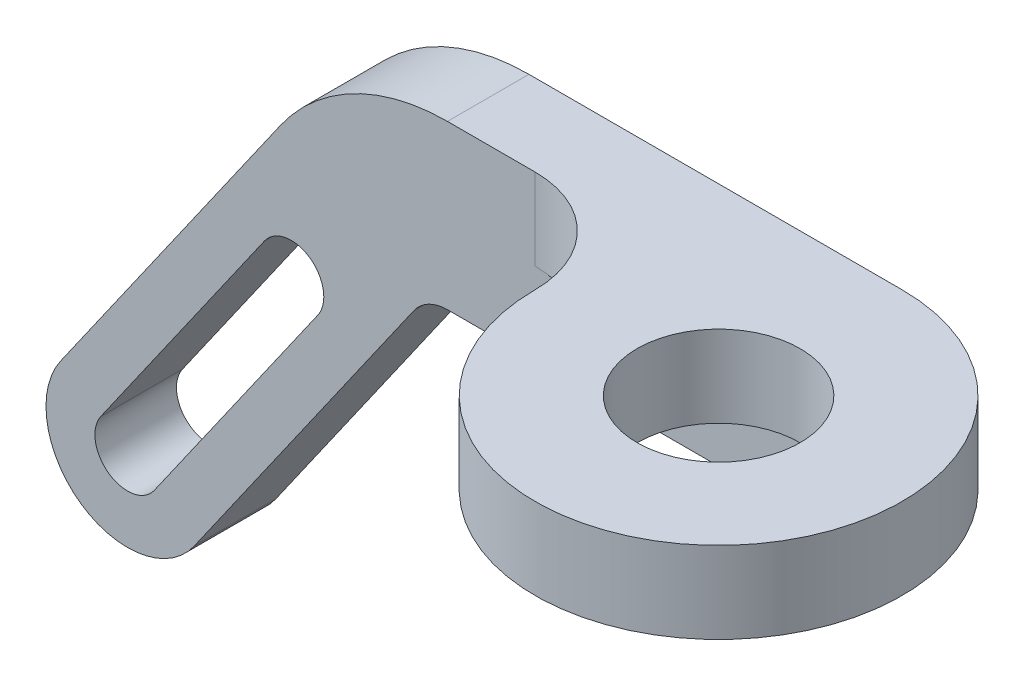
ISO-10303-21;
HEADER;
FILE_DESCRIPTION(('STEP AP214'),'2;1');
FILE_NAME('part.step','',(''),(''),'','','');
FILE_SCHEMA(('AUTOMOTIVE_DESIGN { 1 0 10303 214 1 1 1 1 }'));
ENDSEC;
DATA;
#1=APPLICATION_CONTEXT('core data for automotive mechanical design processes');
#2=APPLICATION_PROTOCOL_DEFINITION('international standard','automotive_design',2000,#1);
#3=PRODUCT_CONTEXT('',#1,'mechanical');
#4=PRODUCT('Part','Part','',(#3));
#5=PRODUCT_RELATED_PRODUCT_CATEGORY('part','',(#4));
#6=PRODUCT_DEFINITION_FORMATION('','',#4);
#7=PRODUCT_DEFINITION_CONTEXT('part definition',#1,'design');
#8=PRODUCT_DEFINITION('design','',#6,#7);
#9=PRODUCT_DEFINITION_SHAPE('','',#8);
#10=(LENGTH_UNIT() NAMED_UNIT(*) SI_UNIT(.MILLI.,.METRE.));
#11=(NAMED_UNIT(*) PLANE_ANGLE_UNIT() SI_UNIT($,.RADIAN.));
#12=(NAMED_UNIT(*) SI_UNIT($,.STERADIAN.) SOLID_ANGLE_UNIT());
#13=UNCERTAINTY_MEASURE_WITH_UNIT(LENGTH_MEASURE(1.E-05),#10,'distance_accuracy_value','');
#14=(GEOMETRIC_REPRESENTATION_CONTEXT(3) GLOBAL_UNCERTAINTY_ASSIGNED_CONTEXT((#13)) GLOBAL_UNIT_ASSIGNED_CONTEXT((#10,
#11,#12)) REPRESENTATION_CONTEXT('',''));
#15=CARTESIAN_POINT('',(0.,0.,0.));
#16=DIRECTION('',(0.,0.,1.));
#17=DIRECTION('',(1.,0.,0.));
#18=AXIS2_PLACEMENT_3D('',#15,#16,#17);
#19=CARTESIAN_POINT('',(61.3570505088352,33.1382695259347,5.));
#20=DIRECTION('',(-1.,0.,0.));
#21=DIRECTION('',(0.,-1.,0.));
#22=AXIS2_PLACEMENT_3D('',#19,#20,#21);
#23=PLANE('',#22);
#24=CARTESIAN_POINT('',(61.3570505088353,18.1382695259347,0.));
#25=DIRECTION('',(1.,0.,0.));
#26=DIRECTION('',(0.,0.,-1.));
#27=AXIS2_PLACEMENT_3D('',#24,#25,#26);
#28=CIRCLE('',#27,0.875000000000001);
#29=CARTESIAN_POINT('',(61.3570505088353,18.1382695259347,-0.875000000000002));
#30=VERTEX_POINT('',#29);
#31=EDGE_CURVE('E149',#30,#30,#28,.T.);
#32=ORIENTED_EDGE('',*,*,#31,.F.);
#33=EDGE_LOOP('',(#32));
#34=FACE_BOUND('',#33,.T.);
#35=DIRECTION('',(0.,0.,-1.));
#36=VECTOR('',#35,1.);
#37=CARTESIAN_POINT('',(61.3570505088353,23.1382695259347,11.3010627053414));
#38=LINE('',#37,#36);
#39=CARTESIAN_POINT('',(61.3570505088353,23.1382695259347,5.));
#40=VERTEX_POINT('',#39);
#41=CARTESIAN_POINT('',(61.3570505088353,23.1382695259347,-5.));
#42=VERTEX_POINT('',#41);
#43=EDGE_CURVE('E168',#40,#42,#38,.T.);
#44=ORIENTED_EDGE('',*,*,#43,.F.);
#45=DIRECTION('',(0.,1.,0.));
#46=VECTOR('',#45,1.);
#47=CARTESIAN_POINT('',(61.3570505088352,33.1382695259347,5.));
#48=LINE('',#47,#46);
#49=CARTESIAN_POINT('',(61.3570505088353,13.1382695259347,5.));
#50=VERTEX_POINT('',#49);
#51=EDGE_CURVE('E210',#50,#40,#48,.T.);
#52=ORIENTED_EDGE('',*,*,#51,.F.);
#53=DIRECTION('',(0.,0.,-1.));
#54=VECTOR('',#53,1.);
#55=CARTESIAN_POINT('',(61.3570505088353,13.1382695259347,5.));
#56=LINE('',#55,#54);
#57=CARTESIAN_POINT('',(61.3570505088353,13.1382695259347,-5.));
#58=VERTEX_POINT('',#57);
#59=EDGE_CURVE('E228',#50,#58,#56,.T.);
#60=ORIENTED_EDGE('',*,*,#59,.T.);
#61=DIRECTION('',(0.,1.,0.));
#62=VECTOR('',#61,1.);
#63=CARTESIAN_POINT('',(61.3570505088352,33.1382695259347,-5.));
#64=LINE('',#63,#62);
#65=EDGE_CURVE('E209',#58,#42,#64,.T.);
#66=ORIENTED_EDGE('',*,*,#65,.T.);
#67=EDGE_LOOP('',(#44,#52,#60,#66));
#68=FACE_BOUND('',#67,.T.);
#69=ADVANCED_FACE('F34',(#34,#68),#23,.F.);
#70=CARTESIAN_POINT('',(15.5942925108019,8.13826952593468,5.));
#71=DIRECTION('',(0.,0.,1.));
#72=DIRECTION('',(1.,0.,0.));
#73=AXIS2_PLACEMENT_3D('',#70,#71,#72);
#74=PLANE('',#73);
#75=DIRECTION('',(0.,1.,0.));
#76=VECTOR('',#75,1.);
#77=CARTESIAN_POINT('',(26.3570505088352,23.1382695259347,5.));
#78=LINE('',#77,#76);
#79=CARTESIAN_POINT('',(26.3570505088352,23.1382695259347,5.));
#80=VERTEX_POINT('',#79);
#81=CARTESIAN_POINT('',(26.3570505088352,33.1382695259347,5.));
#82=VERTEX_POINT('',#81);
#83=EDGE_CURVE('E170',#80,#82,#78,.T.);
#84=ORIENTED_EDGE('',*,*,#83,.T.);
#85=DIRECTION('',(-1.,0.,0.));
#86=VECTOR('',#85,1.);
#87=CARTESIAN_POINT('',(15.5942925108019,33.1382695259347,5.));
#88=LINE('',#87,#86);
#89=CARTESIAN_POINT('',(15.5942925108019,33.1382695259347,5.));
#90=VERTEX_POINT('',#89);
#91=EDGE_CURVE('E213',#82,#90,#88,.T.);
#92=ORIENTED_EDGE('',*,*,#91,.T.);
#93=CARTESIAN_POINT('',(15.5942925108019,8.13826952593466,5.));
#94=DIRECTION('',(0.,0.,1.));
#95=DIRECTION('',(1.,0.,0.));
#96=AXIS2_PLACEMENT_3D('',#93,#94,#95);
#97=CIRCLE('',#96,25.);
#98=CARTESIAN_POINT('',(-4.88450859642281,22.4776804347109,5.));
#99=VERTEX_POINT('',#98);
#100=EDGE_CURVE('E216',#90,#99,#97,.T.);
#101=ORIENTED_EDGE('',*,*,#100,.T.);
#102=DIRECTION('',(-0.57357643635105,-0.819152044288989,0.));
#103=VECTOR('',#102,1.);
#104=CARTESIAN_POINT('',(-4.88450859642281,22.4776804347109,5.));
#105=LINE('',#104,#103);
#106=CARTESIAN_POINT('',(-31.8344699340547,-16.0108531314047,5.));
#107=VERTEX_POINT('',#106);
#108=EDGE_CURVE('E218',#99,#107,#105,.T.);
#109=ORIENTED_EDGE('',*,*,#108,.T.);
#110=CARTESIAN_POINT('',(-23.6429494911648,-21.7466174949152,5.));
#111=DIRECTION('',(0.,0.,1.));
#112=DIRECTION('',(1.,0.,0.));
#113=AXIS2_PLACEMENT_3D('',#110,#111,#112);
#114=CIRCLE('',#113,10.);
#115=CARTESIAN_POINT('',(-15.4514290482749,-27.4823818584257,5.));
#116=VERTEX_POINT('',#115);
#117=EDGE_CURVE('E220',#107,#116,#114,.T.);
#118=ORIENTED_EDGE('',*,*,#117,.T.);
#119=DIRECTION('',(0.573576436351049,0.819152044288989,0.));
#120=VECTOR('',#119,1.);
#121=CARTESIAN_POINT('',(11.498532289357,11.0061517076899,5.));
#122=LINE('',#121,#120);
#123=CARTESIAN_POINT('',(11.498532289357,11.0061517076899,5.));
#124=VERTEX_POINT('',#123);
#125=EDGE_CURVE('E222',#116,#124,#122,.T.);
#126=ORIENTED_EDGE('',*,*,#125,.T.);
#127=CARTESIAN_POINT('',(15.5942925108019,8.13826952593468,5.));
#128=DIRECTION('',(0.,0.,-1.));
#129=DIRECTION('',(1.,0.,0.));
#130=AXIS2_PLACEMENT_3D('',#127,#128,#129);
#131=CIRCLE('',#130,5.);
#132=CARTESIAN_POINT('',(15.5942925108019,13.1382695259347,5.));
#133=VERTEX_POINT('',#132);
#134=EDGE_CURVE('E224',#124,#133,#131,.T.);
#135=ORIENTED_EDGE('',*,*,#134,.T.);
#136=DIRECTION('',(1.,0.,0.));
#137=VECTOR('',#136,1.);
#138=CARTESIAN_POINT('',(15.5942925108019,13.1382695259347,5.));
#139=LINE('',#138,#137);
#140=EDGE_CURVE('E226',#133,#50,#139,.T.);
#141=ORIENTED_EDGE('',*,*,#140,.T.);
#142=ORIENTED_EDGE('',*,*,#51,.T.);
#143=DIRECTION('',(-1.,0.,0.));
#144=VECTOR('',#143,1.);
#145=CARTESIAN_POINT('',(-12.2631316034933,23.1382695259347,5.));
#146=LINE('',#145,#144);
#147=EDGE_CURVE('E158',#40,#80,#146,.T.);
#148=ORIENTED_EDGE('',*,*,#147,.T.);
#149=EDGE_LOOP('',(#84,#92,#101,#109,#118,#126,#135,#141,#142,#148));
#150=FACE_BOUND('',#149,.T.);
#151=DIRECTION('',(0.573576436351049,0.81915204428899,0.));
#152=VECTOR('',#151,1.);
#153=CARTESIAN_POINT('',(-20.3663413140088,-24.0409232403194,5.));
#154=LINE('',#153,#152);
#155=CARTESIAN_POINT('',(-20.3663413140088,-24.0409232403194,5.));
#156=VERTEX_POINT('',#155);
#157=CARTESIAN_POINT('',(-0.291166041722065,4.62939830979524,5.));
#158=VERTEX_POINT('',#157);
#159=EDGE_CURVE('E186',#156,#158,#154,.T.);
#160=ORIENTED_EDGE('',*,*,#159,.F.);
#161=CARTESIAN_POINT('',(-23.6429494911648,-21.7466174949152,5.));
#162=DIRECTION('',(0.,0.,1.));
#163=DIRECTION('',(1.,0.,0.));
#164=AXIS2_PLACEMENT_3D('',#161,#162,#163);
#165=CIRCLE('',#164,3.99999999999999);
#166=CARTESIAN_POINT('',(-26.9195576683207,-19.452311749511,5.));
#167=VERTEX_POINT('',#166);
#168=EDGE_CURVE('E184',#167,#156,#165,.T.);
#169=ORIENTED_EDGE('',*,*,#168,.F.);
#170=DIRECTION('',(-0.573576436351049,-0.81915204428899,0.));
#171=VECTOR('',#170,1.);
#172=CARTESIAN_POINT('',(-26.9195576683207,-19.452311749511,5.));
#173=LINE('',#172,#171);
#174=CARTESIAN_POINT('',(-6.84438239603398,9.21800980060363,5.));
#175=VERTEX_POINT('',#174);
#176=EDGE_CURVE('E191',#175,#167,#173,.T.);
#177=ORIENTED_EDGE('',*,*,#176,.F.);
#178=CARTESIAN_POINT('',(-3.56777421887801,6.92370405519944,5.));
#179=DIRECTION('',(0.,0.,1.));
#180=DIRECTION('',(1.,0.,0.));
#181=AXIS2_PLACEMENT_3D('',#178,#179,#180);
#182=CIRCLE('',#181,3.99999999999999);
#183=EDGE_CURVE('E189',#158,#175,#182,.T.);
#184=ORIENTED_EDGE('',*,*,#183,.F.);
#185=EDGE_LOOP('',(#160,#169,#177,#184));
#186=FACE_BOUND('',#185,.T.);
#187=ADVANCED_FACE('F285',(#150,#186),#74,.T.);
#188=CARTESIAN_POINT('',(15.5942925108019,8.13826952593468,-5.));
#189=DIRECTION('',(0.,0.,1.));
#190=DIRECTION('',(1.,0.,0.));
#191=AXIS2_PLACEMENT_3D('',#188,#189,#190);
#192=PLANE('',#191);
#193=ORIENTED_EDGE('',*,*,#65,.F.);
#194=DIRECTION('',(1.,0.,0.));
#195=VECTOR('',#194,1.);
#196=CARTESIAN_POINT('',(15.5942925108019,13.1382695259347,-5.));
#197=LINE('',#196,#195);
#198=CARTESIAN_POINT('',(15.5942925108019,13.1382695259347,-5.));
#199=VERTEX_POINT('',#198);
#200=EDGE_CURVE('E214',#199,#58,#197,.T.);
#201=ORIENTED_EDGE('',*,*,#200,.F.);
#202=CARTESIAN_POINT('',(15.5942925108019,8.13826952593468,-5.));
#203=DIRECTION('',(0.,0.,-1.));
#204=DIRECTION('',(1.,0.,0.));
#205=AXIS2_PLACEMENT_3D('',#202,#203,#204);
#206=CIRCLE('',#205,5.);
#207=CARTESIAN_POINT('',(11.498532289357,11.0061517076899,-5.));
#208=VERTEX_POINT('',#207);
#209=EDGE_CURVE('E241',#208,#199,#206,.T.);
#210=ORIENTED_EDGE('',*,*,#209,.F.);
#211=DIRECTION('',(0.573576436351049,0.819152044288989,0.));
#212=VECTOR('',#211,1.);
#213=CARTESIAN_POINT('',(11.498532289357,11.0061517076899,-5.));
#214=LINE('',#213,#212);
#215=CARTESIAN_POINT('',(-15.4514290482749,-27.4823818584257,-5.));
#216=VERTEX_POINT('',#215);
#217=EDGE_CURVE('E239',#216,#208,#214,.T.);
#218=ORIENTED_EDGE('',*,*,#217,.F.);
#219=CARTESIAN_POINT('',(-23.6429494911648,-21.7466174949152,-5.));
#220=DIRECTION('',(0.,0.,1.));
#221=DIRECTION('',(1.,0.,0.));
#222=AXIS2_PLACEMENT_3D('',#219,#220,#221);
#223=CIRCLE('',#222,10.);
#224=CARTESIAN_POINT('',(-31.8344699340547,-16.0108531314047,-5.));
#225=VERTEX_POINT('',#224);
#226=EDGE_CURVE('E237',#225,#216,#223,.T.);
#227=ORIENTED_EDGE('',*,*,#226,.F.);
#228=DIRECTION('',(-0.57357643635105,-0.819152044288989,0.));
#229=VECTOR('',#228,1.);
#230=CARTESIAN_POINT('',(-4.88450859642281,22.4776804347109,-5.));
#231=LINE('',#230,#229);
#232=CARTESIAN_POINT('',(-4.88450859642281,22.4776804347109,-5.));
#233=VERTEX_POINT('',#232);
#234=EDGE_CURVE('E235',#233,#225,#231,.T.);
#235=ORIENTED_EDGE('',*,*,#234,.F.);
#236=CARTESIAN_POINT('',(15.5942925108019,8.13826952593466,-5.));
#237=DIRECTION('',(0.,0.,1.));
#238=DIRECTION('',(1.,0.,0.));
#239=AXIS2_PLACEMENT_3D('',#236,#237,#238);
#240=CIRCLE('',#239,25.);
#241=CARTESIAN_POINT('',(15.5942925108019,33.1382695259347,-5.));
#242=VERTEX_POINT('',#241);
#243=EDGE_CURVE('E233',#242,#233,#240,.T.);
#244=ORIENTED_EDGE('',*,*,#243,.F.);
#245=DIRECTION('',(-1.,0.,0.));
#246=VECTOR('',#245,1.);
#247=CARTESIAN_POINT('',(15.5942925108019,33.1382695259347,-5.));
#248=LINE('',#247,#246);
#249=CARTESIAN_POINT('',(61.3570505088352,33.1382695259347,-5.));
#250=VERTEX_POINT('',#249);
#251=EDGE_CURVE('E231',#250,#242,#248,.T.);
#252=ORIENTED_EDGE('',*,*,#251,.F.);
#253=DIRECTION('',(0.,1.,0.));
#254=VECTOR('',#253,1.);
#255=CARTESIAN_POINT('',(61.3570505088353,23.1382695259347,-5.));
#256=LINE('',#255,#254);
#257=EDGE_CURVE('E177',#42,#250,#256,.T.);
#258=ORIENTED_EDGE('',*,*,#257,.F.);
#259=EDGE_LOOP('',(#193,#201,#210,#218,#227,#235,#244,#252,#258));
#260=FACE_BOUND('',#259,.T.);
#261=CARTESIAN_POINT('',(-23.6429494911648,-21.7466174949152,-5.));
#262=DIRECTION('',(0.,0.,1.));
#263=DIRECTION('',(1.,0.,0.));
#264=AXIS2_PLACEMENT_3D('',#261,#262,#263);
#265=CIRCLE('',#264,3.99999999999999);
#266=CARTESIAN_POINT('',(-26.9195576683207,-19.452311749511,-5.));
#267=VERTEX_POINT('',#266);
#268=CARTESIAN_POINT('',(-20.3663413140088,-24.0409232403194,-5.));
#269=VERTEX_POINT('',#268);
#270=EDGE_CURVE('E56',#267,#269,#265,.T.);
#271=ORIENTED_EDGE('',*,*,#270,.T.);
#272=DIRECTION('',(0.573576436351049,0.81915204428899,0.));
#273=VECTOR('',#272,1.);
#274=CARTESIAN_POINT('',(-20.3663413140088,-24.0409232403194,-5.));
#275=LINE('',#274,#273);
#276=CARTESIAN_POINT('',(-0.291166041722065,4.62939830979524,-5.));
#277=VERTEX_POINT('',#276);
#278=EDGE_CURVE('E195',#269,#277,#275,.T.);
#279=ORIENTED_EDGE('',*,*,#278,.T.);
#280=CARTESIAN_POINT('',(-3.56777421887801,6.92370405519944,-5.));
#281=DIRECTION('',(0.,0.,1.));
#282=DIRECTION('',(1.,0.,0.));
#283=AXIS2_PLACEMENT_3D('',#280,#281,#282);
#284=CIRCLE('',#283,3.99999999999999);
#285=CARTESIAN_POINT('',(-6.84438239603397,9.21800980060363,-5.));
#286=VERTEX_POINT('',#285);
#287=EDGE_CURVE('E198',#277,#286,#284,.T.);
#288=ORIENTED_EDGE('',*,*,#287,.T.);
#289=DIRECTION('',(-0.573576436351049,-0.81915204428899,0.));
#290=VECTOR('',#289,1.);
#291=CARTESIAN_POINT('',(-26.9195576683207,-19.452311749511,-5.));
#292=LINE('',#291,#290);
#293=EDGE_CURVE('E187',#286,#267,#292,.T.);
#294=ORIENTED_EDGE('',*,*,#293,.T.);
#295=EDGE_LOOP('',(#271,#279,#288,#294));
#296=FACE_BOUND('',#295,.T.);
#297=ADVANCED_FACE('F270',(#260,#296),#192,.F.);
#298=CARTESIAN_POINT('',(15.5942925108019,33.1382695259347,5.));
#299=DIRECTION('',(0.,-1.,0.));
#300=DIRECTION('',(1.,0.,0.));
#301=AXIS2_PLACEMENT_3D('',#298,#299,#300);
#302=PLANE('',#301);
#303=ORIENTED_EDGE('',*,*,#91,.F.);
#304=CARTESIAN_POINT('',(26.3570505088352,33.1382695259347,17.5));
#305=DIRECTION('',(0.,1.,0.));
#306=DIRECTION('',(-1.,0.,0.));
#307=AXIS2_PLACEMENT_3D('',#304,#305,#306);
#308=CIRCLE('',#307,12.5);
#309=CARTESIAN_POINT('',(38.8570505088352,33.1382695259347,17.5));
#310=VERTEX_POINT('',#309);
#311=EDGE_CURVE('E173',#82,#310,#308,.F.);
#312=ORIENTED_EDGE('',*,*,#311,.T.);
#313=CARTESIAN_POINT('',(61.3570505088352,33.1382695259347,17.5));
#314=DIRECTION('',(0.,1.,0.));
#315=DIRECTION('',(-1.,0.,0.));
#316=AXIS2_PLACEMENT_3D('',#313,#314,#315);
#317=CIRCLE('',#316,22.5);
#318=EDGE_CURVE('E159',#310,#250,#317,.T.);
#319=ORIENTED_EDGE('',*,*,#318,.T.);
#320=ORIENTED_EDGE('',*,*,#251,.T.);
#321=DIRECTION('',(0.,0.,-1.));
#322=VECTOR('',#321,1.);
#323=CARTESIAN_POINT('',(15.5942925108019,33.1382695259347,5.));
#324=LINE('',#323,#322);
#325=EDGE_CURVE('E11',#90,#242,#324,.T.);
#326=ORIENTED_EDGE('',*,*,#325,.F.);
#327=EDGE_LOOP('',(#303,#312,#319,#320,#326));
#328=FACE_BOUND('',#327,.T.);
#329=CARTESIAN_POINT('',(61.3570505088352,33.1382695259347,17.5));
#330=DIRECTION('',(0.,1.,0.));
#331=DIRECTION('',(-1.,0.,0.));
#332=AXIS2_PLACEMENT_3D('',#329,#330,#331);
#333=CIRCLE('',#332,9.99999999999999);
#334=CARTESIAN_POINT('',(51.3570505088353,33.1382695259347,17.5));
#335=VERTEX_POINT('',#334);
#336=EDGE_CURVE('E152',#335,#335,#333,.T.);
#337=ORIENTED_EDGE('',*,*,#336,.F.);
#338=EDGE_LOOP('',(#337));
#339=FACE_BOUND('',#338,.T.);
#340=ADVANCED_FACE('F292',(#328,#339),#302,.F.);
#341=CARTESIAN_POINT('',(15.5942925108019,8.13826952593466,5.));
#342=DIRECTION('',(0.,0.,-1.));
#343=DIRECTION('',(-1.,0.,0.));
#344=AXIS2_PLACEMENT_3D('',#341,#342,#343);
#345=CYLINDRICAL_SURFACE('',#344,25.);
#346=ORIENTED_EDGE('',*,*,#243,.T.);
#347=DIRECTION('',(0.,0.,-1.));
#348=VECTOR('',#347,1.);
#349=CARTESIAN_POINT('',(-4.88450859642281,22.4776804347109,5.));
#350=LINE('',#349,#348);
#351=EDGE_CURVE('E41',#99,#233,#350,.T.);
#352=ORIENTED_EDGE('',*,*,#351,.F.);
#353=ORIENTED_EDGE('',*,*,#100,.F.);
#354=ORIENTED_EDGE('',*,*,#325,.T.);
#355=EDGE_LOOP('',(#346,#352,#353,#354));
#356=FACE_BOUND('',#355,.T.);
#357=ADVANCED_FACE('F290',(#356),#345,.T.);
#358=CARTESIAN_POINT('',(-4.88450859642281,22.4776804347109,5.));
#359=DIRECTION('',(0.819152044288989,-0.573576436351051,0.));
#360=DIRECTION('',(0.573576436351051,0.819152044288989,0.));
#361=AXIS2_PLACEMENT_3D('',#358,#359,#360);
#362=PLANE('',#361);
#363=ORIENTED_EDGE('',*,*,#234,.T.);
#364=DIRECTION('',(0.,0.,-1.));
#365=VECTOR('',#364,1.);
#366=CARTESIAN_POINT('',(-31.8344699340547,-16.0108531314047,5.));
#367=LINE('',#366,#365);
#368=EDGE_CURVE('E255',#107,#225,#367,.T.);
#369=ORIENTED_EDGE('',*,*,#368,.F.);
#370=ORIENTED_EDGE('',*,*,#108,.F.);
#371=ORIENTED_EDGE('',*,*,#351,.T.);
#372=EDGE_LOOP('',(#363,#369,#370,#371));
#373=FACE_BOUND('',#372,.T.);
#374=ADVANCED_FACE('F262',(#373),#362,.F.);
#375=CARTESIAN_POINT('',(-23.6429494911648,-21.7466174949152,5.));
#376=DIRECTION('',(0.,0.,-1.));
#377=DIRECTION('',(-1.,0.,0.));
#378=AXIS2_PLACEMENT_3D('',#375,#376,#377);
#379=CYLINDRICAL_SURFACE('',#378,10.);
#380=ORIENTED_EDGE('',*,*,#226,.T.);
#381=DIRECTION('',(0.,0.,-1.));
#382=VECTOR('',#381,1.);
#383=CARTESIAN_POINT('',(-15.4514290482749,-27.4823818584257,5.));
#384=LINE('',#383,#382);
#385=EDGE_CURVE('E252',#116,#216,#384,.T.);
#386=ORIENTED_EDGE('',*,*,#385,.F.);
#387=ORIENTED_EDGE('',*,*,#117,.F.);
#388=ORIENTED_EDGE('',*,*,#368,.T.);
#389=EDGE_LOOP('',(#380,#386,#387,#388));
#390=FACE_BOUND('',#389,.T.);
#391=ADVANCED_FACE('F277',(#390),#379,.T.);
#392=CARTESIAN_POINT('',(11.498532289357,11.0061517076899,5.));
#393=DIRECTION('',(-0.819152044288989,0.573576436351049,0.));
#394=DIRECTION('',(-0.57357643635105,-0.81915204428899,0.));
#395=AXIS2_PLACEMENT_3D('',#392,#393,#394);
#396=PLANE('',#395);
#397=ORIENTED_EDGE('',*,*,#217,.T.);
#398=DIRECTION('',(0.,0.,-1.));
#399=VECTOR('',#398,1.);
#400=CARTESIAN_POINT('',(11.498532289357,11.0061517076899,5.));
#401=LINE('',#400,#399);
#402=EDGE_CURVE('E249',#124,#208,#401,.T.);
#403=ORIENTED_EDGE('',*,*,#402,.F.);
#404=ORIENTED_EDGE('',*,*,#125,.F.);
#405=ORIENTED_EDGE('',*,*,#385,.T.);
#406=EDGE_LOOP('',(#397,#403,#404,#405));
#407=FACE_BOUND('',#406,.T.);
#408=ADVANCED_FACE('F281',(#407),#396,.F.);
#409=CARTESIAN_POINT('',(15.5942925108019,8.13826952593468,5.));
#410=DIRECTION('',(0.,0.,-1.));
#411=DIRECTION('',(-1.,0.,0.));
#412=AXIS2_PLACEMENT_3D('',#409,#410,#411);
#413=CYLINDRICAL_SURFACE('',#412,5.);
#414=ORIENTED_EDGE('',*,*,#209,.T.);
#415=DIRECTION('',(0.,0.,-1.));
#416=VECTOR('',#415,1.);
#417=CARTESIAN_POINT('',(15.5942925108019,13.1382695259347,5.));
#418=LINE('',#417,#416);
#419=EDGE_CURVE('E246',#133,#199,#418,.T.);
#420=ORIENTED_EDGE('',*,*,#419,.F.);
#421=ORIENTED_EDGE('',*,*,#134,.F.);
#422=ORIENTED_EDGE('',*,*,#402,.T.);
#423=EDGE_LOOP('',(#414,#420,#421,#422));
#424=FACE_BOUND('',#423,.T.);
#425=ADVANCED_FACE('F306',(#424),#413,.F.);
#426=CARTESIAN_POINT('',(15.5942925108019,13.1382695259347,5.));
#427=DIRECTION('',(0.,1.,0.));
#428=DIRECTION('',(-1.,0.,0.));
#429=AXIS2_PLACEMENT_3D('',#426,#427,#428);
#430=PLANE('',#429);
#431=ORIENTED_EDGE('',*,*,#200,.T.);
#432=ORIENTED_EDGE('',*,*,#59,.F.);
#433=ORIENTED_EDGE('',*,*,#140,.F.);
#434=ORIENTED_EDGE('',*,*,#419,.T.);
#435=EDGE_LOOP('',(#431,#432,#433,#434));
#436=FACE_BOUND('',#435,.T.);
#437=ADVANCED_FACE('F304',(#436),#430,.F.);
#438=CARTESIAN_POINT('',(-23.6429494911648,-21.7466174949152,5.));
#439=DIRECTION('',(0.,0.,-1.));
#440=DIRECTION('',(-1.,0.,0.));
#441=AXIS2_PLACEMENT_3D('',#438,#439,#440);
#442=CYLINDRICAL_SURFACE('',#441,3.99999999999999);
#443=ORIENTED_EDGE('',*,*,#270,.F.);
#444=DIRECTION('',(0.,0.,-1.));
#445=VECTOR('',#444,1.);
#446=CARTESIAN_POINT('',(-26.9195576683207,-19.452311749511,5.));
#447=LINE('',#446,#445);
#448=EDGE_CURVE('E193',#167,#267,#447,.T.);
#449=ORIENTED_EDGE('',*,*,#448,.F.);
#450=ORIENTED_EDGE('',*,*,#168,.T.);
#451=DIRECTION('',(0.,0.,-1.));
#452=VECTOR('',#451,1.);
#453=CARTESIAN_POINT('',(-20.3663413140088,-24.0409232403194,5.));
#454=LINE('',#453,#452);
#455=EDGE_CURVE('E207',#156,#269,#454,.T.);
#456=ORIENTED_EDGE('',*,*,#455,.T.);
#457=EDGE_LOOP('',(#443,#449,#450,#456));
#458=FACE_BOUND('',#457,.T.);
#459=ADVANCED_FACE('F313',(#458),#442,.F.);
#460=CARTESIAN_POINT('',(-20.3663413140088,-24.0409232403194,5.));
#461=DIRECTION('',(-0.81915204428899,0.573576436351049,0.));
#462=DIRECTION('',(-0.573576436351049,-0.81915204428899,0.));
#463=AXIS2_PLACEMENT_3D('',#460,#461,#462);
#464=PLANE('',#463);
#465=ORIENTED_EDGE('',*,*,#278,.F.);
#466=ORIENTED_EDGE('',*,*,#455,.F.);
#467=ORIENTED_EDGE('',*,*,#159,.T.);
#468=DIRECTION('',(0.,0.,-1.));
#469=VECTOR('',#468,1.);
#470=CARTESIAN_POINT('',(-0.291166041722065,4.62939830979524,5.));
#471=LINE('',#470,#469);
#472=EDGE_CURVE('E205',#158,#277,#471,.T.);
#473=ORIENTED_EDGE('',*,*,#472,.T.);
#474=EDGE_LOOP('',(#465,#466,#467,#473));
#475=FACE_BOUND('',#474,.T.);
#476=ADVANCED_FACE('F350',(#475),#464,.T.);
#477=CARTESIAN_POINT('',(-3.56777421887801,6.92370405519944,5.));
#478=DIRECTION('',(0.,0.,-1.));
#479=DIRECTION('',(-1.,0.,0.));
#480=AXIS2_PLACEMENT_3D('',#477,#478,#479);
#481=CYLINDRICAL_SURFACE('',#480,3.99999999999999);
#482=ORIENTED_EDGE('',*,*,#287,.F.);
#483=ORIENTED_EDGE('',*,*,#472,.F.);
#484=ORIENTED_EDGE('',*,*,#183,.T.);
#485=DIRECTION('',(0.,0.,-1.));
#486=VECTOR('',#485,1.);
#487=CARTESIAN_POINT('',(-6.84438239603397,9.21800980060363,5.));
#488=LINE('',#487,#486);
#489=EDGE_CURVE('E48',#175,#286,#488,.T.);
#490=ORIENTED_EDGE('',*,*,#489,.T.);
#491=EDGE_LOOP('',(#482,#483,#484,#490));
#492=FACE_BOUND('',#491,.T.);
#493=ADVANCED_FACE('F347',(#492),#481,.F.);
#494=CARTESIAN_POINT('',(-26.9195576683207,-19.452311749511,5.));
#495=DIRECTION('',(0.81915204428899,-0.573576436351049,0.));
#496=DIRECTION('',(0.573576436351049,0.81915204428899,0.));
#497=AXIS2_PLACEMENT_3D('',#494,#495,#496);
#498=PLANE('',#497);
#499=ORIENTED_EDGE('',*,*,#293,.F.);
#500=ORIENTED_EDGE('',*,*,#489,.F.);
#501=ORIENTED_EDGE('',*,*,#176,.T.);
#502=ORIENTED_EDGE('',*,*,#448,.T.);
#503=EDGE_LOOP('',(#499,#500,#501,#502));
#504=FACE_BOUND('',#503,.T.);
#505=ADVANCED_FACE('F338',(#504),#498,.T.);
#506=CARTESIAN_POINT('',(61.3570505088352,23.1382695259347,17.5));
#507=DIRECTION('',(0.,1.,0.));
#508=DIRECTION('',(-1.,0.,0.));
#509=AXIS2_PLACEMENT_3D('',#506,#507,#508);
#510=CYLINDRICAL_SURFACE('',#509,22.5);
#511=ORIENTED_EDGE('',*,*,#318,.F.);
#512=DIRECTION('',(0.,1.,0.));
#513=VECTOR('',#512,1.);
#514=CARTESIAN_POINT('',(38.8570505088352,23.1382695259347,17.5));
#515=LINE('',#514,#513);
#516=CARTESIAN_POINT('',(38.8570505088352,23.1382695259347,17.5));
#517=VERTEX_POINT('',#516);
#518=EDGE_CURVE('E180',#517,#310,#515,.T.);
#519=ORIENTED_EDGE('',*,*,#518,.F.);
#520=CARTESIAN_POINT('',(61.3570505088352,23.1382695259347,17.5));
#521=DIRECTION('',(0.,1.,0.));
#522=DIRECTION('',(-1.,0.,0.));
#523=AXIS2_PLACEMENT_3D('',#520,#521,#522);
#524=CIRCLE('',#523,22.5);
#525=EDGE_CURVE('E165',#517,#42,#524,.T.);
#526=ORIENTED_EDGE('',*,*,#525,.T.);
#527=ORIENTED_EDGE('',*,*,#257,.T.);
#528=EDGE_LOOP('',(#511,#519,#526,#527));
#529=FACE_BOUND('',#528,.T.);
#530=ADVANCED_FACE('F334',(#529),#510,.T.);
#531=CARTESIAN_POINT('',(61.3570505088352,23.1382695259347,17.5));
#532=DIRECTION('',(0.,1.,0.));
#533=DIRECTION('',(-1.,0.,0.));
#534=AXIS2_PLACEMENT_3D('',#531,#532,#533);
#535=CYLINDRICAL_SURFACE('',#534,9.99999999999999);
#536=CARTESIAN_POINT('',(61.3570505088352,23.1382695259347,17.5));
#537=DIRECTION('',(0.,1.,0.));
#538=DIRECTION('',(-1.,0.,0.));
#539=AXIS2_PLACEMENT_3D('',#536,#537,#538);
#540=CIRCLE('',#539,9.99999999999999);
#541=CARTESIAN_POINT('',(51.3570505088353,23.1382695259347,17.5));
#542=VERTEX_POINT('',#541);
#543=EDGE_CURVE('E155',#542,#542,#540,.T.);
#544=ORIENTED_EDGE('',*,*,#543,.F.);
#545=EDGE_LOOP('',(#544));
#546=FACE_BOUND('',#545,.T.);
#547=ORIENTED_EDGE('',*,*,#336,.T.);
#548=EDGE_LOOP('',(#547));
#549=FACE_BOUND('',#548,.T.);
#550=ADVANCED_FACE('F337',(#546,#549),#535,.F.);
#551=CARTESIAN_POINT('',(26.3570505088352,23.1382695259347,17.5));
#552=DIRECTION('',(0.,1.,0.));
#553=DIRECTION('',(-1.,0.,0.));
#554=AXIS2_PLACEMENT_3D('',#551,#552,#553);
#555=CYLINDRICAL_SURFACE('',#554,12.5);
#556=ORIENTED_EDGE('',*,*,#311,.F.);
#557=ORIENTED_EDGE('',*,*,#83,.F.);
#558=CARTESIAN_POINT('',(26.3570505088352,23.1382695259347,17.5));
#559=DIRECTION('',(0.,1.,0.));
#560=DIRECTION('',(-1.,0.,0.));
#561=AXIS2_PLACEMENT_3D('',#558,#559,#560);
#562=CIRCLE('',#561,12.5);
#563=EDGE_CURVE('E162',#80,#517,#562,.F.);
#564=ORIENTED_EDGE('',*,*,#563,.T.);
#565=ORIENTED_EDGE('',*,*,#518,.T.);
#566=EDGE_LOOP('',(#556,#557,#564,#565));
#567=FACE_BOUND('',#566,.T.);
#568=ADVANCED_FACE('F330',(#567),#555,.F.);
#569=CARTESIAN_POINT('',(-12.2631316034933,23.1382695259347,11.3010627053414));
#570=DIRECTION('',(0.,1.,0.));
#571=DIRECTION('',(-1.,0.,0.));
#572=AXIS2_PLACEMENT_3D('',#569,#570,#571);
#573=PLANE('',#572);
#574=ORIENTED_EDGE('',*,*,#543,.T.);
#575=EDGE_LOOP('',(#574));
#576=FACE_BOUND('',#575,.T.);
#577=ORIENTED_EDGE('',*,*,#147,.F.);
#578=ORIENTED_EDGE('',*,*,#43,.T.);
#579=ORIENTED_EDGE('',*,*,#525,.F.);
#580=ORIENTED_EDGE('',*,*,#563,.F.);
#581=EDGE_LOOP('',(#577,#578,#579,#580));
#582=FACE_BOUND('',#581,.T.);
#583=ADVANCED_FACE('F325',(#576,#582),#573,.F.);
#584=CARTESIAN_POINT('',(61.3570505088353,18.1382695259347,0.));
#585=DIRECTION('',(1.,0.,0.));
#586=DIRECTION('',(0.,0.,-1.));
#587=AXIS2_PLACEMENT_3D('',#584,#585,#586);
#588=CYLINDRICAL_SURFACE('',#587,0.875000000000001);
#589=CARTESIAN_POINT('',(56.3570505088353,18.1382695259347,0.));
#590=DIRECTION('',(1.,0.,0.));
#591=DIRECTION('',(0.,0.,-1.));
#592=AXIS2_PLACEMENT_3D('',#589,#590,#591);
#593=CIRCLE('',#592,0.875000000000001);
#594=CARTESIAN_POINT('',(56.3570505088353,18.1382695259347,-0.875000000000002));
#595=VERTEX_POINT('',#594);
#596=EDGE_CURVE('E147',#595,#595,#593,.T.);
#597=ORIENTED_EDGE('',*,*,#596,.F.);
#598=EDGE_LOOP('',(#597));
#599=FACE_BOUND('',#598,.T.);
#600=ORIENTED_EDGE('',*,*,#31,.T.);
#601=EDGE_LOOP('',(#600));
#602=FACE_BOUND('',#601,.T.);
#603=ADVANCED_FACE('F143',(#599,#602),#588,.F.);
#604=CARTESIAN_POINT('',(56.3570505088353,18.1382695259347,0.));
#605=DIRECTION('',(1.,0.,0.));
#606=DIRECTION('',(0.,0.,-1.));
#607=AXIS2_PLACEMENT_3D('',#604,#605,#606);
#608=CONICAL_SURFACE('',#607,0.875000000000001,1.02974425867665);
#609=CARTESIAN_POINT('',(55.8312974671861,18.1382695259347,0.));
#610=VERTEX_POINT('',#609);
#611=VERTEX_LOOP('',#610);
#612=FACE_BOUND('',#611,.T.);
#613=ORIENTED_EDGE('',*,*,#596,.T.);
#614=EDGE_LOOP('',(#613));
#615=FACE_BOUND('',#614,.T.);
#616=ADVANCED_FACE('F140',(#612,#615),#608,.F.);
#617=CLOSED_SHELL('',(#69,#187,#297,#340,#357,#374,#391,#408,#425,#437,#459,#476,#493,#505,#530,
#550,#568,#583,#603,#616));
#618=MANIFOLD_SOLID_BREP('B2',#617);
#619=ADVANCED_BREP_SHAPE_REPRESENTATION('',(#18,#618),#14);
#620=SHAPE_DEFINITION_REPRESENTATION(#9,#619);
ENDSEC;
END-ISO-10303-21;
